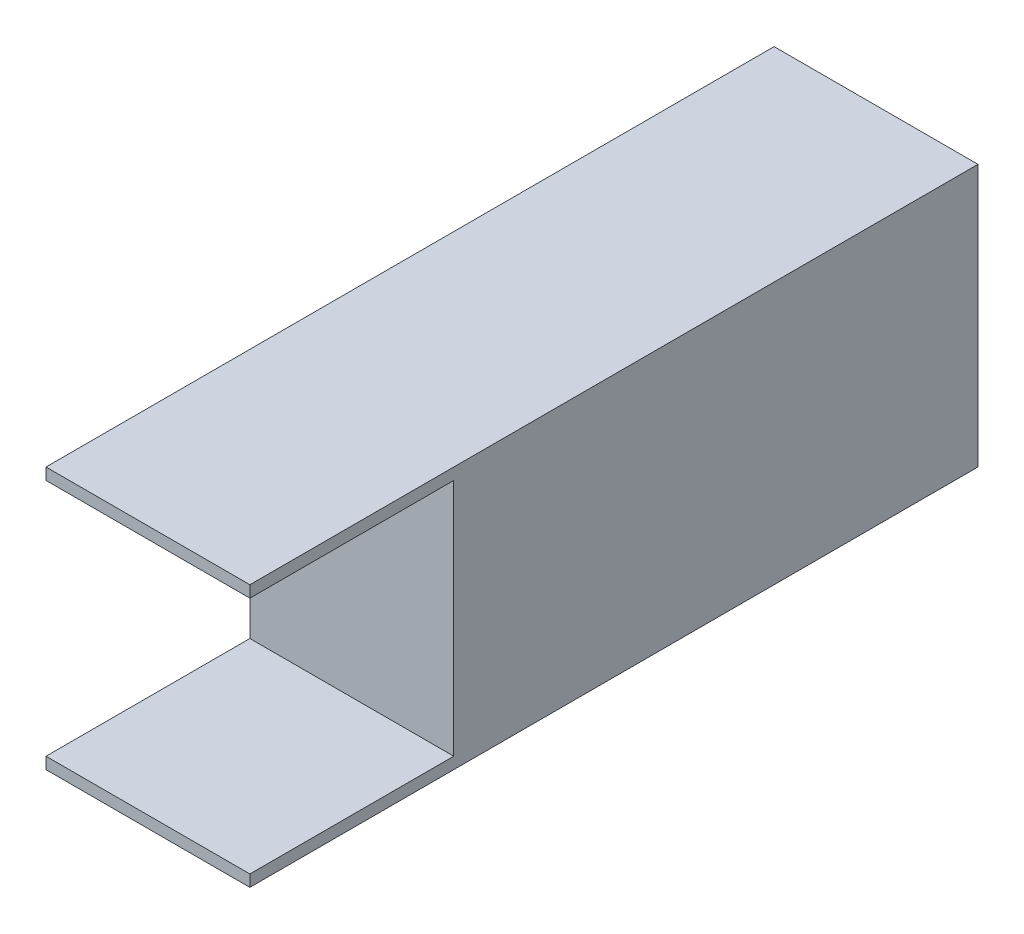
ISO-10303-21;
HEADER;
FILE_DESCRIPTION(('STEP AP214'),'2;1');
FILE_NAME('part.step','',(''),(''),'','','');
FILE_SCHEMA(('AUTOMOTIVE_DESIGN { 1 0 10303 214 1 1 1 1 }'));
ENDSEC;
DATA;
#1=APPLICATION_CONTEXT('core data for automotive mechanical design processes');
#2=APPLICATION_PROTOCOL_DEFINITION('international standard','automotive_design',2000,#1);
#3=PRODUCT_CONTEXT('',#1,'mechanical');
#4=PRODUCT('Part','Part','',(#3));
#5=PRODUCT_RELATED_PRODUCT_CATEGORY('part','',(#4));
#6=PRODUCT_DEFINITION_FORMATION('','',#4);
#7=PRODUCT_DEFINITION_CONTEXT('part definition',#1,'design');
#8=PRODUCT_DEFINITION('design','',#6,#7);
#9=PRODUCT_DEFINITION_SHAPE('','',#8);
#10=(LENGTH_UNIT() NAMED_UNIT(*) SI_UNIT(.MILLI.,.METRE.));
#11=(NAMED_UNIT(*) PLANE_ANGLE_UNIT() SI_UNIT($,.RADIAN.));
#12=(NAMED_UNIT(*) SI_UNIT($,.STERADIAN.) SOLID_ANGLE_UNIT());
#13=UNCERTAINTY_MEASURE_WITH_UNIT(LENGTH_MEASURE(1.E-05),#10,'distance_accuracy_value','');
#14=(GEOMETRIC_REPRESENTATION_CONTEXT(3) GLOBAL_UNCERTAINTY_ASSIGNED_CONTEXT((#13)) GLOBAL_UNIT_ASSIGNED_CONTEXT((#10,
#11,#12)) REPRESENTATION_CONTEXT('',''));
#15=CARTESIAN_POINT('',(0.,0.,0.));
#16=DIRECTION('',(0.,0.,1.));
#17=DIRECTION('',(1.,0.,0.));
#18=AXIS2_PLACEMENT_3D('',#15,#16,#17);
#19=CARTESIAN_POINT('',(0.,0.,125.));
#20=DIRECTION('',(0.,0.,-1.));
#21=DIRECTION('',(-1.,0.,0.));
#22=AXIS2_PLACEMENT_3D('',#19,#20,#21);
#23=PLANE('',#22);
#24=DIRECTION('',(0.,1.,0.));
#25=VECTOR('',#24,1.);
#26=CARTESIAN_POINT('',(17.5,-22.5,125.));
#27=LINE('',#26,#25);
#28=CARTESIAN_POINT('',(17.5,-22.5,125.));
#29=VERTEX_POINT('',#28);
#30=CARTESIAN_POINT('',(17.5,-20.5,125.));
#31=VERTEX_POINT('',#30);
#32=EDGE_CURVE('E143',#29,#31,#27,.T.);
#33=ORIENTED_EDGE('',*,*,#32,.T.);
#34=DIRECTION('',(-1.,0.,0.));
#35=VECTOR('',#34,1.);
#36=CARTESIAN_POINT('',(17.5,-20.5,125.));
#37=LINE('',#36,#35);
#38=CARTESIAN_POINT('',(-17.5,-20.5,125.));
#39=VERTEX_POINT('',#38);
#40=EDGE_CURVE('E137',#31,#39,#37,.T.);
#41=ORIENTED_EDGE('',*,*,#40,.T.);
#42=DIRECTION('',(0.,-1.,0.));
#43=VECTOR('',#42,1.);
#44=CARTESIAN_POINT('',(-17.5,-22.5,125.));
#45=LINE('',#44,#43);
#46=CARTESIAN_POINT('',(-17.5,-22.5,125.));
#47=VERTEX_POINT('',#46);
#48=EDGE_CURVE('E147',#39,#47,#45,.T.);
#49=ORIENTED_EDGE('',*,*,#48,.T.);
#50=DIRECTION('',(1.,0.,0.));
#51=VECTOR('',#50,1.);
#52=CARTESIAN_POINT('',(-17.5,-22.5,125.));
#53=LINE('',#52,#51);
#54=EDGE_CURVE('E60',#47,#29,#53,.T.);
#55=ORIENTED_EDGE('',*,*,#54,.T.);
#56=EDGE_LOOP('',(#33,#41,#49,#55));
#57=FACE_BOUND('',#56,.T.);
#58=ADVANCED_FACE('F36',(#57),#23,.F.);
#59=CARTESIAN_POINT('',(17.5,-22.5,125.));
#60=DIRECTION('',(-1.,0.,0.));
#61=DIRECTION('',(0.,0.,1.));
#62=AXIS2_PLACEMENT_3D('',#59,#60,#61);
#63=PLANE('',#62);
#64=DIRECTION('',(0.,-1.,0.));
#65=VECTOR('',#64,1.);
#66=CARTESIAN_POINT('',(17.5,20.5,90.));
#67=LINE('',#66,#65);
#68=CARTESIAN_POINT('',(17.5,20.5,90.));
#69=VERTEX_POINT('',#68);
#70=CARTESIAN_POINT('',(17.5,-20.5,90.));
#71=VERTEX_POINT('',#70);
#72=EDGE_CURVE('E121',#69,#71,#67,.T.);
#73=ORIENTED_EDGE('',*,*,#72,.T.);
#74=DIRECTION('',(0.,0.,1.));
#75=VECTOR('',#74,1.);
#76=CARTESIAN_POINT('',(17.5,-20.5,125.));
#77=LINE('',#76,#75);
#78=EDGE_CURVE('E126',#71,#31,#77,.T.);
#79=ORIENTED_EDGE('',*,*,#78,.T.);
#80=ORIENTED_EDGE('',*,*,#32,.F.);
#81=DIRECTION('',(0.,0.,-1.));
#82=VECTOR('',#81,1.);
#83=CARTESIAN_POINT('',(17.5,-22.5,125.));
#84=LINE('',#83,#82);
#85=CARTESIAN_POINT('',(17.5,-22.5,0.));
#86=VERTEX_POINT('',#85);
#87=EDGE_CURVE('E152',#29,#86,#84,.T.);
#88=ORIENTED_EDGE('',*,*,#87,.T.);
#89=DIRECTION('',(0.,1.,0.));
#90=VECTOR('',#89,1.);
#91=CARTESIAN_POINT('',(17.5,-22.5,0.));
#92=LINE('',#91,#90);
#93=CARTESIAN_POINT('',(17.5,22.5,0.));
#94=VERTEX_POINT('',#93);
#95=EDGE_CURVE('E140',#86,#94,#92,.T.);
#96=ORIENTED_EDGE('',*,*,#95,.T.);
#97=DIRECTION('',(0.,0.,-1.));
#98=VECTOR('',#97,1.);
#99=CARTESIAN_POINT('',(17.5,22.5,125.));
#100=LINE('',#99,#98);
#101=CARTESIAN_POINT('',(17.5,22.5,125.));
#102=VERTEX_POINT('',#101);
#103=EDGE_CURVE('E11',#102,#94,#100,.T.);
#104=ORIENTED_EDGE('',*,*,#103,.F.);
#105=CARTESIAN_POINT('',(17.5,20.5,125.));
#106=VERTEX_POINT('',#105);
#107=EDGE_CURVE('E88',#106,#102,#27,.T.);
#108=ORIENTED_EDGE('',*,*,#107,.F.);
#109=DIRECTION('',(0.,0.,-1.));
#110=VECTOR('',#109,1.);
#111=CARTESIAN_POINT('',(17.5,20.5,125.));
#112=LINE('',#111,#110);
#113=EDGE_CURVE('E51',#106,#69,#112,.T.);
#114=ORIENTED_EDGE('',*,*,#113,.T.);
#115=EDGE_LOOP('',(#73,#79,#80,#88,#96,#104,#108,#114));
#116=FACE_BOUND('',#115,.T.);
#117=ADVANCED_FACE('F38',(#116),#63,.F.);
#118=CARTESIAN_POINT('',(-17.5,22.5,125.));
#119=DIRECTION('',(0.,-1.,0.));
#120=DIRECTION('',(0.,0.,-1.));
#121=AXIS2_PLACEMENT_3D('',#118,#119,#120);
#122=PLANE('',#121);
#123=DIRECTION('',(-1.,0.,0.));
#124=VECTOR('',#123,1.);
#125=CARTESIAN_POINT('',(-17.5,22.5,0.));
#126=LINE('',#125,#124);
#127=CARTESIAN_POINT('',(-17.5,22.5,0.));
#128=VERTEX_POINT('',#127);
#129=EDGE_CURVE('E155',#94,#128,#126,.T.);
#130=ORIENTED_EDGE('',*,*,#129,.T.);
#131=DIRECTION('',(0.,0.,-1.));
#132=VECTOR('',#131,1.);
#133=CARTESIAN_POINT('',(-17.5,22.5,125.));
#134=LINE('',#133,#132);
#135=CARTESIAN_POINT('',(-17.5,22.5,125.));
#136=VERTEX_POINT('',#135);
#137=EDGE_CURVE('E44',#136,#128,#134,.T.);
#138=ORIENTED_EDGE('',*,*,#137,.F.);
#139=DIRECTION('',(-1.,0.,0.));
#140=VECTOR('',#139,1.);
#141=CARTESIAN_POINT('',(-17.5,22.5,125.));
#142=LINE('',#141,#140);
#143=EDGE_CURVE('E145',#102,#136,#142,.T.);
#144=ORIENTED_EDGE('',*,*,#143,.F.);
#145=ORIENTED_EDGE('',*,*,#103,.T.);
#146=EDGE_LOOP('',(#130,#138,#144,#145));
#147=FACE_BOUND('',#146,.T.);
#148=ADVANCED_FACE('F180',(#147),#122,.F.);
#149=CARTESIAN_POINT('',(-17.5,-22.5,125.));
#150=DIRECTION('',(1.,0.,0.));
#151=DIRECTION('',(0.,0.,-1.));
#152=AXIS2_PLACEMENT_3D('',#149,#150,#151);
#153=PLANE('',#152);
#154=ORIENTED_EDGE('',*,*,#48,.F.);
#155=DIRECTION('',(0.,0.,1.));
#156=VECTOR('',#155,1.);
#157=CARTESIAN_POINT('',(-17.5,-20.5,125.));
#158=LINE('',#157,#156);
#159=CARTESIAN_POINT('',(-17.5,-20.5,90.));
#160=VERTEX_POINT('',#159);
#161=EDGE_CURVE('E129',#160,#39,#158,.T.);
#162=ORIENTED_EDGE('',*,*,#161,.F.);
#163=DIRECTION('',(0.,-1.,0.));
#164=VECTOR('',#163,1.);
#165=CARTESIAN_POINT('',(-17.5,20.5,90.));
#166=LINE('',#165,#164);
#167=CARTESIAN_POINT('',(-17.5,20.5,90.));
#168=VERTEX_POINT('',#167);
#169=EDGE_CURVE('E131',#168,#160,#166,.T.);
#170=ORIENTED_EDGE('',*,*,#169,.F.);
#171=DIRECTION('',(0.,0.,-1.));
#172=VECTOR('',#171,1.);
#173=CARTESIAN_POINT('',(-17.5,20.5,125.));
#174=LINE('',#173,#172);
#175=CARTESIAN_POINT('',(-17.5,20.5,125.));
#176=VERTEX_POINT('',#175);
#177=EDGE_CURVE('E113',#176,#168,#174,.T.);
#178=ORIENTED_EDGE('',*,*,#177,.F.);
#179=EDGE_CURVE('E148',#136,#176,#45,.T.);
#180=ORIENTED_EDGE('',*,*,#179,.F.);
#181=ORIENTED_EDGE('',*,*,#137,.T.);
#182=DIRECTION('',(0.,-1.,0.));
#183=VECTOR('',#182,1.);
#184=CARTESIAN_POINT('',(-17.5,-22.5,0.));
#185=LINE('',#184,#183);
#186=CARTESIAN_POINT('',(-17.5,-22.5,0.));
#187=VERTEX_POINT('',#186);
#188=EDGE_CURVE('E157',#128,#187,#185,.T.);
#189=ORIENTED_EDGE('',*,*,#188,.T.);
#190=DIRECTION('',(0.,0.,-1.));
#191=VECTOR('',#190,1.);
#192=CARTESIAN_POINT('',(-17.5,-22.5,125.));
#193=LINE('',#192,#191);
#194=EDGE_CURVE('E161',#47,#187,#193,.T.);
#195=ORIENTED_EDGE('',*,*,#194,.F.);
#196=EDGE_LOOP('',(#154,#162,#170,#178,#180,#181,#189,#195));
#197=FACE_BOUND('',#196,.T.);
#198=ADVANCED_FACE('F168',(#197),#153,.F.);
#199=CARTESIAN_POINT('',(-17.5,-22.5,125.));
#200=DIRECTION('',(0.,1.,0.));
#201=DIRECTION('',(0.,0.,1.));
#202=AXIS2_PLACEMENT_3D('',#199,#200,#201);
#203=PLANE('',#202);
#204=DIRECTION('',(1.,0.,0.));
#205=VECTOR('',#204,1.);
#206=CARTESIAN_POINT('',(-17.5,-22.5,0.));
#207=LINE('',#206,#205);
#208=EDGE_CURVE('E81',#187,#86,#207,.T.);
#209=ORIENTED_EDGE('',*,*,#208,.T.);
#210=ORIENTED_EDGE('',*,*,#87,.F.);
#211=ORIENTED_EDGE('',*,*,#54,.F.);
#212=ORIENTED_EDGE('',*,*,#194,.T.);
#213=EDGE_LOOP('',(#209,#210,#211,#212));
#214=FACE_BOUND('',#213,.T.);
#215=ADVANCED_FACE('F175',(#214),#203,.F.);
#216=ORIENTED_EDGE('',*,*,#179,.T.);
#217=DIRECTION('',(-1.,0.,0.));
#218=VECTOR('',#217,1.);
#219=CARTESIAN_POINT('',(17.5,20.5,125.));
#220=LINE('',#219,#218);
#221=EDGE_CURVE('E118',#106,#176,#220,.T.);
#222=ORIENTED_EDGE('',*,*,#221,.F.);
#223=ORIENTED_EDGE('',*,*,#107,.T.);
#224=ORIENTED_EDGE('',*,*,#143,.T.);
#225=EDGE_LOOP('',(#216,#222,#223,#224));
#226=FACE_BOUND('',#225,.T.);
#227=ADVANCED_FACE('F179',(#226),#23,.F.);
#228=CARTESIAN_POINT('',(0.,0.,0.));
#229=DIRECTION('',(0.,0.,-1.));
#230=DIRECTION('',(-1.,0.,0.));
#231=AXIS2_PLACEMENT_3D('',#228,#229,#230);
#232=PLANE('',#231);
#233=ORIENTED_EDGE('',*,*,#95,.F.);
#234=ORIENTED_EDGE('',*,*,#208,.F.);
#235=ORIENTED_EDGE('',*,*,#188,.F.);
#236=ORIENTED_EDGE('',*,*,#129,.F.);
#237=EDGE_LOOP('',(#233,#234,#235,#236));
#238=FACE_BOUND('',#237,.T.);
#239=ADVANCED_FACE('F173',(#238),#232,.T.);
#240=CARTESIAN_POINT('',(17.5,-20.5,125.));
#241=DIRECTION('',(0.,-1.,0.));
#242=DIRECTION('',(0.,0.,-1.));
#243=AXIS2_PLACEMENT_3D('',#240,#241,#242);
#244=PLANE('',#243);
#245=ORIENTED_EDGE('',*,*,#161,.T.);
#246=ORIENTED_EDGE('',*,*,#40,.F.);
#247=ORIENTED_EDGE('',*,*,#78,.F.);
#248=DIRECTION('',(-1.,0.,0.));
#249=VECTOR('',#248,1.);
#250=CARTESIAN_POINT('',(17.5,-20.5,90.));
#251=LINE('',#250,#249);
#252=EDGE_CURVE('E117',#71,#160,#251,.T.);
#253=ORIENTED_EDGE('',*,*,#252,.T.);
#254=EDGE_LOOP('',(#245,#246,#247,#253));
#255=FACE_BOUND('',#254,.T.);
#256=ADVANCED_FACE('F178',(#255),#244,.F.);
#257=CARTESIAN_POINT('',(17.5,20.5,90.));
#258=DIRECTION('',(0.,0.,-1.));
#259=DIRECTION('',(-1.,0.,0.));
#260=AXIS2_PLACEMENT_3D('',#257,#258,#259);
#261=PLANE('',#260);
#262=ORIENTED_EDGE('',*,*,#169,.T.);
#263=ORIENTED_EDGE('',*,*,#252,.F.);
#264=ORIENTED_EDGE('',*,*,#72,.F.);
#265=DIRECTION('',(-1.,0.,0.));
#266=VECTOR('',#265,1.);
#267=CARTESIAN_POINT('',(17.5,20.5,90.));
#268=LINE('',#267,#266);
#269=EDGE_CURVE('E109',#69,#168,#268,.T.);
#270=ORIENTED_EDGE('',*,*,#269,.T.);
#271=EDGE_LOOP('',(#262,#263,#264,#270));
#272=FACE_BOUND('',#271,.T.);
#273=ADVANCED_FACE('F122',(#272),#261,.F.);
#274=CARTESIAN_POINT('',(17.5,20.5,125.));
#275=DIRECTION('',(0.,1.,0.));
#276=DIRECTION('',(0.,0.,1.));
#277=AXIS2_PLACEMENT_3D('',#274,#275,#276);
#278=PLANE('',#277);
#279=ORIENTED_EDGE('',*,*,#177,.T.);
#280=ORIENTED_EDGE('',*,*,#269,.F.);
#281=ORIENTED_EDGE('',*,*,#113,.F.);
#282=ORIENTED_EDGE('',*,*,#221,.T.);
#283=EDGE_LOOP('',(#279,#280,#281,#282));
#284=FACE_BOUND('',#283,.T.);
#285=ADVANCED_FACE('F111',(#284),#278,.F.);
#286=CLOSED_SHELL('',(#58,#117,#148,#198,#215,#227,#239,#256,#273,#285));
#287=MANIFOLD_SOLID_BREP('B2',#286);
#288=ADVANCED_BREP_SHAPE_REPRESENTATION('',(#18,#287),#14);
#289=SHAPE_DEFINITION_REPRESENTATION(#9,#288);
ENDSEC;
END-ISO-10303-21;
